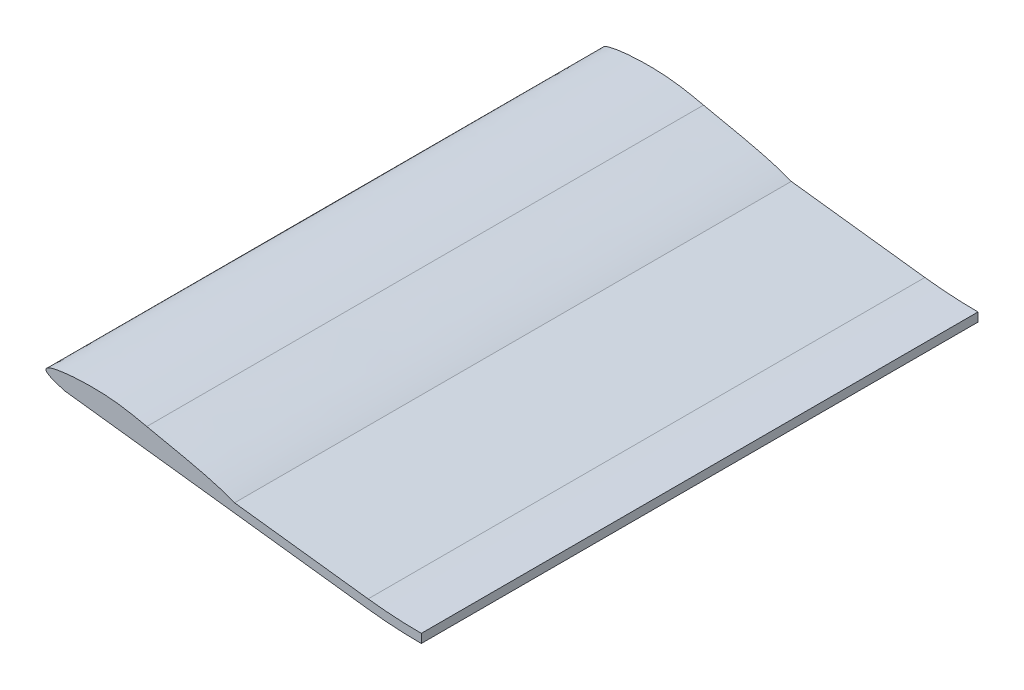
ISO-10303-21;
HEADER;
FILE_DESCRIPTION(('STEP AP214'),'2;1');
FILE_NAME('part.step','',(''),(''),'','','');
FILE_SCHEMA(('AUTOMOTIVE_DESIGN { 1 0 10303 214 1 1 1 1 }'));
ENDSEC;
DATA;
#1=APPLICATION_CONTEXT('core data for automotive mechanical design processes');
#2=APPLICATION_PROTOCOL_DEFINITION('international standard','automotive_design',2000,#1);
#3=PRODUCT_CONTEXT('',#1,'mechanical');
#4=PRODUCT('Part','Part','',(#3));
#5=PRODUCT_RELATED_PRODUCT_CATEGORY('part','',(#4));
#6=PRODUCT_DEFINITION_FORMATION('','',#4);
#7=PRODUCT_DEFINITION_CONTEXT('part definition',#1,'design');
#8=PRODUCT_DEFINITION('design','',#6,#7);
#9=PRODUCT_DEFINITION_SHAPE('','',#8);
#10=(LENGTH_UNIT() NAMED_UNIT(*) SI_UNIT(.MILLI.,.METRE.));
#11=(NAMED_UNIT(*) PLANE_ANGLE_UNIT() SI_UNIT($,.RADIAN.));
#12=(NAMED_UNIT(*) SI_UNIT($,.STERADIAN.) SOLID_ANGLE_UNIT());
#13=UNCERTAINTY_MEASURE_WITH_UNIT(LENGTH_MEASURE(1.E-05),#10,'distance_accuracy_value','');
#14=(GEOMETRIC_REPRESENTATION_CONTEXT(3) GLOBAL_UNCERTAINTY_ASSIGNED_CONTEXT((#13)) GLOBAL_UNIT_ASSIGNED_CONTEXT((#10,
#11,#12)) REPRESENTATION_CONTEXT('',''));
#15=CARTESIAN_POINT('',(0.,0.,0.));
#16=DIRECTION('',(0.,0.,1.));
#17=DIRECTION('',(1.,0.,0.));
#18=AXIS2_PLACEMENT_3D('',#15,#16,#17);
#19=CARTESIAN_POINT('',(-1376.89946624241,7.97944159795149,-300.));
#20=CARTESIAN_POINT('',(-1400.62692267339,14.4748176161241,-300.));
#21=CARTESIAN_POINT('',(-1356.47241270451,20.4165278977863,-300.));
#22=CARTESIAN_POINT('',(-1325.57377215526,12.1218735207099,-300.));
#23=CARTESIAN_POINT('',(-1294.16714389737,6.70322635564015,-300.));
#24=CARTESIAN_POINT('',(-1280.44105962162,1.1733876229176,-300.));
#25=B_SPLINE_CURVE_WITH_KNOTS('',3,(#19,#20,#21,#22,#23,#24),.UNSPECIFIED.,.F.,.F.,(4,1,1,4),
(0.,0.297228768096899,0.6124069189747,1.),.UNSPECIFIED.);
#26=DIRECTION('',(0.,0.,1.));
#27=VECTOR('',#26,1.);
#28=SURFACE_OF_LINEAR_EXTRUSION('',#25,#27);
#29=DIRECTION('',(0.,0.,1.));
#30=VECTOR('',#29,1.);
#31=CARTESIAN_POINT('',(-1387.26742948358,13.7744205498702,-300.));
#32=LINE('',#31,#30);
#33=CARTESIAN_POINT('',(-1387.26742948358,13.7744205498701,-616.));
#34=VERTEX_POINT('',#33);
#35=CARTESIAN_POINT('',(-1387.26742948358,13.7744205498702,-300.));
#36=VERTEX_POINT('',#35);
#37=EDGE_CURVE('E13',#34,#36,#32,.T.);
#38=ORIENTED_EDGE('',*,*,#37,.F.);
#39=CARTESIAN_POINT('',(-1376.89946624241,7.97944159795149,-616.));
#40=CARTESIAN_POINT('',(-1377.10559932181,8.03587358965808,-616.));
#41=CARTESIAN_POINT('',(-1377.31156661358,8.09291446148049,-616.));
#42=CARTESIAN_POINT('',(-1377.72572935339,8.20906121368225,-616.));
#43=CARTESIAN_POINT('',(-1377.93392003424,8.26818408733904,-616.));
#44=CARTESIAN_POINT('',(-1378.35202039858,8.38853903831141,-616.));
#45=CARTESIAN_POINT('',(-1378.56192563219,8.44978659180561,-616.));
#46=CARTESIAN_POINT('',(-1378.98293859683,8.57445775450962,-616.));
#47=CARTESIAN_POINT('',(-1379.19404230275,8.63789496779612,-616.));
#48=CARTESIAN_POINT('',(-1379.61692994093,8.76703358194975,-616.));
#49=CARTESIAN_POINT('',(-1379.82871045148,8.83274620515776,-616.));
#50=CARTESIAN_POINT('',(-1380.2524189195,8.96655496809938,-616.));
#51=CARTESIAN_POINT('',(-1380.46434427497,9.03465934888446,-616.));
#52=CARTESIAN_POINT('',(-1381.01661926945,9.21560731824085,-616.));
#53=CARTESIAN_POINT('',(-1381.35634383868,9.33036880620694,-616.));
#54=CARTESIAN_POINT('',(-1382.03278113928,9.56746067515487,-616.));
#55=CARTESIAN_POINT('',(-1382.36949655483,9.68978333205807,-616.));
#56=CARTESIAN_POINT('',(-1382.87104889133,9.88036922150825,-616.));
#57=CARTESIAN_POINT('',(-1383.03729210857,9.94493493954435,-616.));
#58=CARTESIAN_POINT('',(-1383.36865588585,10.076880636935,-616.));
#59=CARTESIAN_POINT('',(-1383.53377647864,10.1442605338004,-616.));
#60=CARTESIAN_POINT('',(-1383.86149752485,10.2818132154702,-616.));
#61=CARTESIAN_POINT('',(-1384.02410752631,10.3519631846966,-616.));
#62=CARTESIAN_POINT('',(-1384.34761813229,10.4960760338678,-616.));
#63=CARTESIAN_POINT('',(-1384.50851888743,10.570038574431,-616.));
#64=CARTESIAN_POINT('',(-1384.82686126228,10.7219573228579,-616.));
#65=CARTESIAN_POINT('',(-1384.98432024166,10.7998769397391,-616.));
#66=CARTESIAN_POINT('',(-1385.29634029246,10.9612864441184,-616.));
#67=CARTESIAN_POINT('',(-1385.45090179693,11.0447754905801,-616.));
#68=CARTESIAN_POINT('',(-1385.75570133815,11.2186366470378,-616.));
#69=CARTESIAN_POINT('',(-1385.90594844763,11.3089925920781,-616.));
#70=CARTESIAN_POINT('',(-1386.12677429788,11.4514583939343,-616.));
#71=CARTESIAN_POINT('',(-1386.19960142951,11.5000845793451,-616.));
#72=CARTESIAN_POINT('',(-1386.34335772149,11.6000579106691,-616.));
#73=CARTESIAN_POINT('',(-1386.41428723876,11.6514045393844,-616.));
#74=CARTESIAN_POINT('',(-1386.53555170717,11.7435233585069,-616.));
#75=CARTESIAN_POINT('',(-1386.58643944335,11.7835669771438,-616.));
#76=CARTESIAN_POINT('',(-1386.6866056491,11.8656933041869,-616.));
#77=CARTESIAN_POINT('',(-1386.73588305617,11.9077773151229,-616.));
#78=CARTESIAN_POINT('',(-1386.83244419358,11.9943143642011,-616.));
#79=CARTESIAN_POINT('',(-1386.87972513602,12.0387705308769,-616.));
#80=CARTESIAN_POINT('',(-1386.97059091361,12.1293005415215,-616.));
#81=CARTESIAN_POINT('',(-1387.01423572422,12.1753137178867,-616.));
#82=CARTESIAN_POINT('',(-1387.09821857093,12.2702207272159,-616.));
#83=CARTESIAN_POINT('',(-1387.13855920956,12.3191122398517,-616.));
#84=CARTESIAN_POINT('',(-1387.21485121182,12.4201126492647,-616.));
#85=CARTESIAN_POINT('',(-1387.25081147707,12.4722146857279,-616.));
#86=CARTESIAN_POINT('',(-1387.30106096528,12.5541229970213,-616.));
#87=CARTESIAN_POINT('',(-1387.3174701123,12.582633549943,-616.));
#88=CARTESIAN_POINT('',(-1387.34845005028,12.6406306504229,-616.));
#89=CARTESIAN_POINT('',(-1387.36302150547,12.6701168404522,-616.));
#90=CARTESIAN_POINT('',(-1387.39002206765,12.7300268742398,-616.));
#91=CARTESIAN_POINT('',(-1387.40245333555,12.7604497352233,-616.));
#92=CARTESIAN_POINT('',(-1387.42488132207,12.822217999786,-616.));
#93=CARTESIAN_POINT('',(-1387.43487526226,12.8535644109792,-616.));
#94=CARTESIAN_POINT('',(-1387.45813685873,12.9393939371932,-616.));
#95=CARTESIAN_POINT('',(-1387.46875829233,12.9946338603826,-616.));
#96=CARTESIAN_POINT('',(-1387.48046370835,13.1061062338817,-616.));
#97=CARTESIAN_POINT('',(-1387.48156012353,13.1623372943333,-616.));
#98=CARTESIAN_POINT('',(-1387.4757327961,13.2461719614413,-616.));
#99=CARTESIAN_POINT('',(-1387.47253393127,13.2740756171652,-616.));
#100=CARTESIAN_POINT('',(-1387.46370953273,13.329482149259,-616.));
#101=CARTESIAN_POINT('',(-1387.4580852809,13.3569852294156,-616.));
#102=CARTESIAN_POINT('',(-1387.43772393909,13.4386508538961,-616.));
#103=CARTESIAN_POINT('',(-1387.4194985435,13.491966056697,-616.));
#104=CARTESIAN_POINT('',(-1387.36788509003,13.6125051150773,-616.));
#105=CARTESIAN_POINT('',(-1387.33146256725,13.6784027181051,-616.));
#106=CARTESIAN_POINT('',(-1387.24878146527,13.8037156121293,-616.));
#107=CARTESIAN_POINT('',(-1387.20249721534,13.8631133607172,-616.));
#108=CARTESIAN_POINT('',(-1387.10784528255,13.9706784381311,-616.));
#109=CARTESIAN_POINT('',(-1387.060067443,14.0193763832744,-616.));
#110=CARTESIAN_POINT('',(-1386.96052103794,14.1125484682299,-616.));
#111=CARTESIAN_POINT('',(-1386.9087488983,14.157018743786,-616.));
#112=CARTESIAN_POINT('',(-1386.80219575232,14.2424261963095,-616.));
#113=CARTESIAN_POINT('',(-1386.74740790063,14.2833547430979,-616.));
#114=CARTESIAN_POINT('',(-1386.6356868198,14.3620951338664,-616.));
#115=CARTESIAN_POINT('',(-1386.57875447175,14.3999082379457,-616.));
#116=CARTESIAN_POINT('',(-1386.45642974705,14.4771870113068,-616.));
#117=CARTESIAN_POINT('',(-1386.39083032273,14.5163233554486,-616.));
#118=CARTESIAN_POINT('',(-1386.25803751536,14.5918031818058,-616.));
#119=CARTESIAN_POINT('',(-1386.19084378736,14.6281460522951,-616.));
#120=CARTESIAN_POINT('',(-1385.98718091869,14.7337244256374,-616.));
#121=CARTESIAN_POINT('',(-1385.84885226192,14.799373967021,-616.));
#122=CARTESIAN_POINT('',(-1385.5689168085,14.9235005623852,-616.));
#123=CARTESIAN_POINT('',(-1385.42730693435,14.9819705296954,-616.));
#124=CARTESIAN_POINT('',(-1385.1410493615,15.0935327548931,-616.));
#125=CARTESIAN_POINT('',(-1384.99638878677,15.1465917663851,-616.));
#126=CARTESIAN_POINT('',(-1384.70564654503,15.2479761349737,-616.));
#127=CARTESIAN_POINT('',(-1384.55956701678,15.296307675713,-616.));
#128=CARTESIAN_POINT('',(-1384.26626332117,15.3890821597214,-616.));
#129=CARTESIAN_POINT('',(-1384.11903974016,15.4335269681485,-616.));
#130=CARTESIAN_POINT('',(-1383.70995727964,15.5521257191271,-616.));
#131=CARTESIAN_POINT('',(-1383.44709363696,15.6228128159153,-616.));
#132=CARTESIAN_POINT('',(-1382.91936385474,15.7563266149848,-616.));
#133=CARTESIAN_POINT('',(-1382.65449740385,15.8191520673311,-616.));
#134=CARTESIAN_POINT('',(-1382.1229650218,15.9385384175811,-616.));
#135=CARTESIAN_POINT('',(-1381.85629705414,15.9950901984809,-616.));
#136=CARTESIAN_POINT('',(-1381.32189468029,16.1029161952263,-616.));
#137=CARTESIAN_POINT('',(-1381.05416024018,16.1541902417516,-616.));
#138=CARTESIAN_POINT('',(-1380.51749162167,16.2523274558758,-616.));
#139=CARTESIAN_POINT('',(-1380.24855627452,16.2991842044673,-616.));
#140=CARTESIAN_POINT('',(-1379.71003661255,16.3890063941388,-616.));
#141=CARTESIAN_POINT('',(-1379.44045228932,16.4319717844294,-616.));
#142=CARTESIAN_POINT('',(-1378.63087313839,16.5557690528167,-616.));
#143=CARTESIAN_POINT('',(-1378.09009502969,16.6314943563582,-616.));
#144=CARTESIAN_POINT('',(-1377.00807863036,16.7719034373336,-616.));
#145=CARTESIAN_POINT('',(-1376.46684273714,16.8366060102775,-616.));
#146=CARTESIAN_POINT('',(-1375.38398166942,16.9567972106447,-616.));
#147=CARTESIAN_POINT('',(-1374.84235764972,17.0122963004009,-616.));
#148=CARTESIAN_POINT('',(-1373.75855999863,17.1153570434646,-616.));
#149=CARTESIAN_POINT('',(-1373.21638663996,17.1629215860796,-616.));
#150=CARTESIAN_POINT('',(-1372.13129037316,17.250989964278,-616.));
#151=CARTESIAN_POINT('',(-1371.58836727717,17.2914914725964,-616.));
#152=CARTESIAN_POINT('',(-1370.45788606029,17.3690277519527,-616.));
#153=CARTESIAN_POINT('',(-1369.87029030527,17.4055123670845,-616.));
#154=CARTESIAN_POINT('',(-1368.69469438734,17.4713562862471,-616.));
#155=CARTESIAN_POINT('',(-1368.10669421964,17.5007155043084,-616.));
#156=CARTESIAN_POINT('',(-1366.92975208821,17.5525731669881,-616.));
#157=CARTESIAN_POINT('',(-1366.34080979512,17.5750641276652,-616.));
#158=CARTESIAN_POINT('',(-1365.1627048489,17.6131659820636,-616.));
#159=CARTESIAN_POINT('',(-1364.57354219659,17.6287769012033,-616.));
#160=CARTESIAN_POINT('',(-1363.39488815817,17.6528790911732,-616.));
#161=CARTESIAN_POINT('',(-1362.80539672663,17.6613681822236,-616.));
#162=CARTESIAN_POINT('',(-1361.62635710593,17.6708262212208,-616.));
#163=CARTESIAN_POINT('',(-1361.03680891679,17.6717951706705,-616.));
#164=CARTESIAN_POINT('',(-1359.26871468234,17.6628630854307,-616.));
#165=CARTESIAN_POINT('',(-1358.0901972813,17.641134449485,-616.));
#166=CARTESIAN_POINT('',(-1355.7354211015,17.5633291457871,-616.));
#167=CARTESIAN_POINT('',(-1354.55916124058,17.5072853824696,-616.));
#168=CARTESIAN_POINT('',(-1352.21047250895,17.3587173298899,-616.));
#169=CARTESIAN_POINT('',(-1351.03804062399,17.2662416437172,-616.));
#170=CARTESIAN_POINT('',(-1349.27898376581,17.099130438101,-616.));
#171=CARTESIAN_POINT('',(-1348.69099798329,17.0384941946363,-616.));
#172=CARTESIAN_POINT('',(-1347.51607457213,16.9078151103728,-616.));
#173=CARTESIAN_POINT('',(-1346.92913693121,16.837772380465,-616.));
#174=CARTESIAN_POINT('',(-1345.75650663328,16.6884650126062,-616.));
#175=CARTESIAN_POINT('',(-1345.17081384181,16.6092014282877,-616.));
#176=CARTESIAN_POINT('',(-1344.00070096476,16.4417904987352,-616.));
#177=CARTESIAN_POINT('',(-1343.41628087928,16.3536431528599,-616.));
#178=CARTESIAN_POINT('',(-1342.24846358651,16.168933334444,-616.));
#179=CARTESIAN_POINT('',(-1341.66506706899,16.0723665106585,-616.));
#180=CARTESIAN_POINT('',(-1340.49960044743,15.871553434744,-616.));
#181=CARTESIAN_POINT('',(-1339.91753034389,15.7673071797265,-616.));
#182=CARTESIAN_POINT('',(-1338.75414898549,15.5519101028218,-616.));
#183=CARTESIAN_POINT('',(-1338.17283883169,15.4407533516865,-616.));
#184=CARTESIAN_POINT('',(-1337.01136023702,15.2126426425003,-616.));
#185=CARTESIAN_POINT('',(-1336.43119179728,15.0956886787599,-616.));
#186=CARTESIAN_POINT('',(-1335.27135903696,14.8570416344822,-616.));
#187=CARTESIAN_POINT('',(-1334.69169546967,14.7353449057238,-616.));
#188=CARTESIAN_POINT('',(-1333.53309740608,14.4885414234781,-616.));
#189=CARTESIAN_POINT('',(-1332.9541629097,14.3634346703651,-616.));
#190=CARTESIAN_POINT('',(-1331.7965852555,14.1110606849079,-616.));
#191=CARTESIAN_POINT('',(-1331.21794223664,13.9837928174276,-616.));
#192=CARTESIAN_POINT('',(-1330.06084064353,13.7284216128202,-616.));
#193=CARTESIAN_POINT('',(-1329.48238206944,13.6003182749474,-616.));
#194=CARTESIAN_POINT('',(-1328.56177330007,13.3967834551106,-616.));
#195=CARTESIAN_POINT('',(-1328.21965242175,13.3212195861388,-616.));
#196=CARTESIAN_POINT('',(-1327.53532582951,13.1704770679976,-616.));
#197=CARTESIAN_POINT('',(-1327.19312011561,13.0952984187186,-616.));
#198=CARTESIAN_POINT('',(-1326.50857390825,12.9455618628941,-616.));
#199=CARTESIAN_POINT('',(-1326.16623341523,12.8710039543062,-616.));
#200=CARTESIAN_POINT('',(-1325.48137285666,12.7227173725383,-616.));
#201=CARTESIAN_POINT('',(-1325.13885279112,12.6489886993577,-616.));
#202=CARTESIAN_POINT('',(-1324.45384036181,12.5022659686637,-616.));
#203=CARTESIAN_POINT('',(-1324.11134807498,12.429271551655,-616.));
#204=CARTESIAN_POINT('',(-1323.42623990157,12.28386490226,-616.));
#205=CARTESIAN_POINT('',(-1323.08362401497,12.2114526700279,-616.));
#206=CARTESIAN_POINT('',(-1322.05562542676,11.9949210280287,-616.));
#207=CARTESIAN_POINT('',(-1321.3700941808,11.8515071819623,-616.));
#208=CARTESIAN_POINT('',(-1319.99914985061,11.56581206236,-616.));
#209=CARTESIAN_POINT('',(-1319.31373687545,11.4235302640729,-616.));
#210=CARTESIAN_POINT('',(-1317.94284733035,11.1392786548157,-616.));
#211=CARTESIAN_POINT('',(-1317.25737076051,10.9973088434122,-616.));
#212=CARTESIAN_POINT('',(-1315.88684576334,10.7130530691468,-616.));
#213=CARTESIAN_POINT('',(-1315.20179729529,10.5707673032964,-616.));
#214=CARTESIAN_POINT('',(-1313.83191912745,10.2851460845697,-616.));
#215=CARTESIAN_POINT('',(-1313.14708942773,10.141810631364,-616.));
#216=CARTESIAN_POINT('',(-1311.09383052273,9.70941761459142,-616.));
#217=CARTESIAN_POINT('',(-1309.72593073338,9.41782942400285,-616.));
#218=CARTESIAN_POINT('',(-1306.99328728128,8.82309915737215,-616.));
#219=CARTESIAN_POINT('',(-1305.62854245887,8.51996244097756,-616.));
#220=CARTESIAN_POINT('',(-1302.9214656525,7.9013198616558,-616.));
#221=CARTESIAN_POINT('',(-1301.57908234811,7.58603977988466,-616.));
#222=CARTESIAN_POINT('',(-1298.899515461,6.93431715587263,-616.));
#223=CARTESIAN_POINT('',(-1297.56233157365,6.5978758739784,-616.));
#224=CARTESIAN_POINT('',(-1294.89451333153,5.89822066925104,-616.));
#225=CARTESIAN_POINT('',(-1293.5638811182,5.53499854199399,-616.));
#226=CARTESIAN_POINT('',(-1290.91070850373,4.77529313800796,-616.));
#227=CARTESIAN_POINT('',(-1289.5881767995,4.37877917887172,-616.));
#228=CARTESIAN_POINT('',(-1287.61264016945,3.75339801911065,-616.));
#229=CARTESIAN_POINT('',(-1286.95485104388,3.53960673793806,-616.));
#230=CARTESIAN_POINT('',(-1285.64301898217,3.10085416624144,-616.));
#231=CARTESIAN_POINT('',(-1284.98897594333,2.87589318359945,-616.));
#232=CARTESIAN_POINT('',(-1283.68288751582,2.41282813502006,-616.));
#233=CARTESIAN_POINT('',(-1283.03085786298,2.17467955296651,-616.));
#234=CARTESIAN_POINT('',(-1281.7319099413,1.68465326262107,-616.));
#235=CARTESIAN_POINT('',(-1281.08499218569,1.43277419536898,-616.));
#236=CARTESIAN_POINT('',(-1280.44105962162,1.1733876229176,-616.));
#237=B_SPLINE_CURVE_WITH_KNOTS('',3,(#39,#40,#41,#42,#43,#44,#45,#46,#47,#48,#49,#50,#51,#52,
#53,#54,#55,#56,#57,#58,#59,#60,#61,#62,#63,#64,#65,#66,#67,#68,#69,#70,#71,#72,#73,#74,#75,#76,
#77,#78,#79,#80,#81,#82,#83,#84,#85,#86,#87,#88,#89,#90,#91,#92,#93,#94,#95,#96,#97,#98,#99,
#100,#101,#102,#103,#104,#105,#106,#107,#108,#109,#110,#111,#112,#113,#114,#115,#116,#117,#118,
#119,#120,#121,#122,#123,#124,#125,#126,#127,#128,#129,#130,#131,#132,#133,#134,#135,#136,#137,
#138,#139,#140,#141,#142,#143,#144,#145,#146,#147,#148,#149,#150,#151,#152,#153,#154,#155,#156,
#157,#158,#159,#160,#161,#162,#163,#164,#165,#166,#167,#168,#169,#170,#171,#172,#173,#174,#175,
#176,#177,#178,#179,#180,#181,#182,#183,#184,#185,#186,#187,#188,#189,#190,#191,#192,#193,#194,
#195,#196,#197,#198,#199,#200,#201,#202,#203,#204,#205,#206,#207,#208,#209,#210,#211,#212,#213,
#214,#215,#216,#217,#218,#219,#220,#221,#222,#223,#224,#225,#226,#227,#228,#229,#230,#231,#232,
#233,#234,#235,#236),.UNSPECIFIED.,.F.,.F.,(4,2,2,2,2,2,2,2,2,2,2,2,2,2,2,2,2,2,2,2,2,2,2,2,2,2,
2,2,2,2,2,2,2,2,2,2,2,2,2,2,2,2,2,2,2,2,2,2,2,2,2,2,2,2,2,2,2,2,2,2,2,2,2,2,2,2,2,2,2,2,2,2,2,2,
2,2,2,2,2,2,2,2,2,2,2,2,2,2,2,2,2,2,2,2,2,2,2,2,4),(0.,0.641154592746128,1.29041849442369,
1.94638712900553,2.60766715794277,3.27288016488498,3.94066790590432,5.01635177545694,
6.09095438561435,6.6259573071867,7.16094455776156,7.69219208949669,8.22339241286647,
8.75035257158444,9.27723333370757,9.80291008332669,10.065569713323,10.3281795856465,
10.5223987803484,10.7167436350056,10.9113514623093,11.1014863007959,11.2914699096956,
11.481060761776,11.5796933107784,11.678290107021,11.7767867604165,11.8753951751834,
12.0434034731278,12.2111924411461,12.2953557880387,12.3794747070118,12.547723599081,
12.7723540117534,12.9975764562909,13.2019424339759,13.406493449483,13.6115296306195,
13.8164824696922,14.0455581495666,14.2746838512757,14.7337143201391,15.1931942982915,
15.6553459931179,16.1168848637935,16.578201022543,17.3946299902428,18.2111885987626,
19.0289187150571,19.8466750575939,20.6656019759419,21.4845395812372,23.1225454928307,
24.7577297632126,26.3910422541026,28.0237586816926,29.6570120759142,31.423147691864,
33.1893046155154,34.957379206863,36.7254472660172,38.4940562810084,40.2626649425498,
43.798317307298,47.3305846680499,50.8581555737525,52.6314045851498,54.4046326939167,
56.177658381195,57.9506841964803,59.7246318177563,61.4985801062894,63.2740720409073,
65.0495657180466,66.8264531906288,68.6033404681826,70.3807593226059,72.1581797639168,
73.2092787718865,74.2603774807273,75.3114727297279,76.3625679779863,77.413120758471,
78.4636738173498,80.5647872484503,82.6648621812686,84.7649341947539,86.8639404244796,
88.9629473131615,93.15881486224,97.3527582891799,101.489360744496,105.625717059459,
109.763345872221,113.904830767026,115.979727780587,118.054567633333,120.136897892016,
122.219434622649),.UNSPECIFIED.);
#238=CARTESIAN_POINT('',(-1376.89946624241,7.97944159795149,-616.));
#239=VERTEX_POINT('',#238);
#240=EDGE_CURVE('E152',#239,#34,#237,.T.);
#241=ORIENTED_EDGE('',*,*,#240,.F.);
#242=DIRECTION('',(0.,0.,1.));
#243=VECTOR('',#242,1.);
#244=CARTESIAN_POINT('',(-1376.89946624241,7.97944159795149,-300.));
#245=LINE('',#244,#243);
#246=CARTESIAN_POINT('',(-1376.89946624241,7.97944159795149,-300.));
#247=VERTEX_POINT('',#246);
#248=EDGE_CURVE('E220',#239,#247,#245,.T.);
#249=ORIENTED_EDGE('',*,*,#248,.T.);
#250=CARTESIAN_POINT('',(-1376.89946624241,7.97944159795149,-300.));
#251=CARTESIAN_POINT('',(-1400.62692267339,14.4748176161241,-300.));
#252=CARTESIAN_POINT('',(-1356.47241270451,20.4165278977863,-300.));
#253=CARTESIAN_POINT('',(-1325.57377215526,12.1218735207099,-300.));
#254=CARTESIAN_POINT('',(-1294.16714389737,6.70322635564015,-300.));
#255=CARTESIAN_POINT('',(-1280.44105962162,1.1733876229176,-300.));
#256=B_SPLINE_CURVE_WITH_KNOTS('',3,(#250,#251,#252,#253,#254,#255),.UNSPECIFIED.,.F.,.F.,(4,1,
1,4),(0.,0.297228768096899,0.6124069189747,1.),.UNSPECIFIED.);
#257=EDGE_CURVE('E207',#247,#36,#256,.T.);
#258=ORIENTED_EDGE('',*,*,#257,.T.);
#259=EDGE_LOOP('',(#38,#241,#249,#258));
#260=FACE_BOUND('',#259,.T.);
#261=ADVANCED_FACE('F55',(#260),#28,.F.);
#262=DIRECTION('',(0.,0.,1.));
#263=VECTOR('',#262,1.);
#264=CARTESIAN_POINT('',(-1330.26950820948,13.7744205498702,-300.));
#265=LINE('',#264,#263);
#266=CARTESIAN_POINT('',(-1330.26950820948,13.7744205498703,-300.));
#267=VERTEX_POINT('',#266);
#268=CARTESIAN_POINT('',(-1330.26950820948,13.7744205498702,-616.));
#269=VERTEX_POINT('',#268);
#270=EDGE_CURVE('E59',#267,#269,#265,.F.);
#271=ORIENTED_EDGE('',*,*,#270,.F.);
#272=CARTESIAN_POINT('',(-1280.44105962162,1.17338762291759,-300.));
#273=VERTEX_POINT('',#272);
#274=EDGE_CURVE('E198',#267,#273,#256,.T.);
#275=ORIENTED_EDGE('',*,*,#274,.T.);
#276=DIRECTION('',(0.,0.,1.));
#277=VECTOR('',#276,1.);
#278=CARTESIAN_POINT('',(-1280.44105962162,1.1733876229176,-300.));
#279=LINE('',#278,#277);
#280=CARTESIAN_POINT('',(-1280.44105962162,1.1733876229176,-616.));
#281=VERTEX_POINT('',#280);
#282=EDGE_CURVE('E225',#281,#273,#279,.T.);
#283=ORIENTED_EDGE('',*,*,#282,.F.);
#284=EDGE_CURVE('E150',#269,#281,#237,.T.);
#285=ORIENTED_EDGE('',*,*,#284,.F.);
#286=EDGE_LOOP('',(#271,#275,#283,#285));
#287=FACE_BOUND('',#286,.T.);
#288=ADVANCED_FACE('F185',(#287),#28,.F.);
#289=CARTESIAN_POINT('',(-1189.74693314729,-15.,-300.));
#290=DIRECTION('',(0.121869343405148,0.992546151641322,0.));
#291=DIRECTION('',(-0.992546151641322,0.121869343405148,0.));
#292=AXIS2_PLACEMENT_3D('',#289,#290,#291);
#293=PLANE('',#292);
#294=DIRECTION('',(0.,0.,-1.));
#295=VECTOR('',#294,1.);
#296=CARTESIAN_POINT('',(-1204.92361396095,-13.1365379103305,-300.));
#297=LINE('',#296,#295);
#298=CARTESIAN_POINT('',(-1204.92361396095,-13.1365379103304,-616.));
#299=VERTEX_POINT('',#298);
#300=CARTESIAN_POINT('',(-1204.92361396095,-13.1365379103305,-300.));
#301=VERTEX_POINT('',#300);
#302=EDGE_CURVE('E231',#299,#301,#297,.F.);
#303=ORIENTED_EDGE('',*,*,#302,.T.);
#304=DIRECTION('',(-0.992546151641322,0.121869343405148,0.));
#305=VECTOR('',#304,1.);
#306=CARTESIAN_POINT('',(-1189.74693314729,-15.,-300.));
#307=LINE('',#306,#305);
#308=EDGE_CURVE('E208',#301,#247,#307,.T.);
#309=ORIENTED_EDGE('',*,*,#308,.T.);
#310=ORIENTED_EDGE('',*,*,#248,.F.);
#311=DIRECTION('',(-0.992546151641322,0.121869343405147,0.));
#312=VECTOR('',#311,1.);
#313=CARTESIAN_POINT('',(-1204.92361396095,-13.1365379103303,-616.));
#314=LINE('',#313,#312);
#315=EDGE_CURVE('E147',#299,#239,#314,.T.);
#316=ORIENTED_EDGE('',*,*,#315,.F.);
#317=EDGE_LOOP('',(#303,#309,#310,#316));
#318=FACE_BOUND('',#317,.T.);
#319=ADVANCED_FACE('F184',(#318),#293,.F.);
#320=EDGE_CURVE('E161',#34,#269,#237,.T.);
#321=ORIENTED_EDGE('',*,*,#320,.F.);
#322=ORIENTED_EDGE('',*,*,#37,.T.);
#323=EDGE_CURVE('E204',#36,#267,#256,.T.);
#324=ORIENTED_EDGE('',*,*,#323,.T.);
#325=ORIENTED_EDGE('',*,*,#270,.T.);
#326=EDGE_LOOP('',(#321,#322,#324,#325));
#327=FACE_BOUND('',#326,.T.);
#328=ADVANCED_FACE('F162',(#327),#28,.F.);
#329=CARTESIAN_POINT('',(-1280.44105962162,1.1733876229176,-300.));
#330=DIRECTION('',(-0.121869343405141,-0.992546151641323,0.));
#331=DIRECTION('',(0.992546151641323,-0.121869343405141,0.));
#332=AXIS2_PLACEMENT_3D('',#329,#330,#331);
#333=PLANE('',#332);
#334=ORIENTED_EDGE('',*,*,#282,.T.);
#335=DIRECTION('',(0.992546151641323,-0.121869343405141,0.));
#336=VECTOR('',#335,1.);
#337=CARTESIAN_POINT('',(-1280.44105962162,1.1733876229176,-300.));
#338=LINE('',#337,#336);
#339=CARTESIAN_POINT('',(-1204.6178008602,-8.13653791033056,-300.));
#340=VERTEX_POINT('',#339);
#341=EDGE_CURVE('E127',#273,#340,#338,.T.);
#342=ORIENTED_EDGE('',*,*,#341,.T.);
#343=DIRECTION('',(0.,0.,1.));
#344=VECTOR('',#343,1.);
#345=CARTESIAN_POINT('',(-1204.6178008602,-8.13653791033053,-300.));
#346=LINE('',#345,#344);
#347=CARTESIAN_POINT('',(-1204.6178008602,-8.1365379103305,-616.));
#348=VERTEX_POINT('',#347);
#349=EDGE_CURVE('E234',#340,#348,#346,.F.);
#350=ORIENTED_EDGE('',*,*,#349,.T.);
#351=DIRECTION('',(0.992546151641323,-0.121869343405141,0.));
#352=VECTOR('',#351,1.);
#353=CARTESIAN_POINT('',(-1280.44105962162,1.1733876229176,-616.));
#354=LINE('',#353,#352);
#355=EDGE_CURVE('E143',#281,#348,#354,.T.);
#356=ORIENTED_EDGE('',*,*,#355,.F.);
#357=EDGE_LOOP('',(#334,#342,#350,#356));
#358=FACE_BOUND('',#357,.T.);
#359=ADVANCED_FACE('F175',(#358),#333,.F.);
#360=CARTESIAN_POINT('',(-1174.45627810966,235.,305.));
#361=DIRECTION('',(0.,0.,-1.));
#362=DIRECTION('',(-1.,0.,0.));
#363=AXIS2_PLACEMENT_3D('',#360,#361,#362);
#364=CYLINDRICAL_SURFACE('',#363,250.);
#365=CARTESIAN_POINT('',(-1174.45627810966,235.,-300.));
#366=DIRECTION('',(0.,0.,-1.));
#367=DIRECTION('',(-1.,0.,0.));
#368=AXIS2_PLACEMENT_3D('',#365,#366,#367);
#369=CIRCLE('',#368,250.);
#370=CARTESIAN_POINT('',(-1174.45627810966,-15.,-300.));
#371=VERTEX_POINT('',#370);
#372=EDGE_CURVE('E218',#301,#371,#369,.F.);
#373=ORIENTED_EDGE('',*,*,#372,.F.);
#374=ORIENTED_EDGE('',*,*,#302,.F.);
#375=CARTESIAN_POINT('',(-1174.45627810966,235.,-616.));
#376=DIRECTION('',(0.,0.,-1.));
#377=DIRECTION('',(-1.,0.,0.));
#378=AXIS2_PLACEMENT_3D('',#375,#376,#377);
#379=CIRCLE('',#378,250.);
#380=CARTESIAN_POINT('',(-1174.45627810966,-14.9999999999999,-616.));
#381=VERTEX_POINT('',#380);
#382=EDGE_CURVE('E138',#381,#299,#379,.T.);
#383=ORIENTED_EDGE('',*,*,#382,.F.);
#384=DIRECTION('',(0.,0.,-1.));
#385=VECTOR('',#384,1.);
#386=CARTESIAN_POINT('',(-1174.45627810966,-15.,305.));
#387=LINE('',#386,#385);
#388=EDGE_CURVE('E134',#371,#381,#387,.T.);
#389=ORIENTED_EDGE('',*,*,#388,.F.);
#390=EDGE_LOOP('',(#373,#374,#383,#389));
#391=FACE_BOUND('',#390,.T.);
#392=ADVANCED_FACE('F177',(#391),#364,.T.);
#393=CARTESIAN_POINT('',(-1174.15046500891,240.,-300.));
#394=DIRECTION('',(0.,0.,-1.));
#395=DIRECTION('',(-1.,0.,0.));
#396=AXIS2_PLACEMENT_3D('',#393,#394,#395);
#397=CYLINDRICAL_SURFACE('',#396,250.);
#398=CARTESIAN_POINT('',(-1174.15046500891,240.,-300.));
#399=DIRECTION('',(0.,0.,-1.));
#400=DIRECTION('',(-1.,0.,0.));
#401=AXIS2_PLACEMENT_3D('',#398,#399,#400);
#402=CIRCLE('',#401,250.);
#403=CARTESIAN_POINT('',(-1174.45627810966,-9.99981295662467,-300.));
#404=VERTEX_POINT('',#403);
#405=EDGE_CURVE('E124',#340,#404,#402,.F.);
#406=ORIENTED_EDGE('',*,*,#405,.T.);
#407=DIRECTION('',(0.,0.,-1.));
#408=VECTOR('',#407,1.);
#409=CARTESIAN_POINT('',(-1174.45627810966,-9.99981295662464,-300.));
#410=LINE('',#409,#408);
#411=CARTESIAN_POINT('',(-1174.45627810966,-9.99981295662464,-616.));
#412=VERTEX_POINT('',#411);
#413=EDGE_CURVE('E119',#404,#412,#410,.T.);
#414=ORIENTED_EDGE('',*,*,#413,.T.);
#415=CARTESIAN_POINT('',(-1174.15046500891,240.,-616.));
#416=DIRECTION('',(0.,0.,1.));
#417=DIRECTION('',(-1.,0.,0.));
#418=AXIS2_PLACEMENT_3D('',#415,#416,#417);
#419=CIRCLE('',#418,250.);
#420=EDGE_CURVE('E123',#348,#412,#419,.T.);
#421=ORIENTED_EDGE('',*,*,#420,.F.);
#422=ORIENTED_EDGE('',*,*,#349,.F.);
#423=EDGE_LOOP('',(#406,#414,#421,#422));
#424=FACE_BOUND('',#423,.T.);
#425=ADVANCED_FACE('F57',(#424),#397,.F.);
#426=CARTESIAN_POINT('',(-1174.15046500891,-400.,-300.));
#427=DIRECTION('',(0.,0.,-1.));
#428=DIRECTION('',(-1.,0.,0.));
#429=AXIS2_PLACEMENT_3D('',#426,#427,#428);
#430=PLANE('',#429);
#431=ORIENTED_EDGE('',*,*,#372,.T.);
#432=DIRECTION('',(0.,1.,0.));
#433=VECTOR('',#432,1.);
#434=CARTESIAN_POINT('',(-1174.45627810966,-16.8133173139919,-300.));
#435=LINE('',#434,#433);
#436=EDGE_CURVE('E128',#371,#404,#435,.T.);
#437=ORIENTED_EDGE('',*,*,#436,.T.);
#438=ORIENTED_EDGE('',*,*,#405,.F.);
#439=ORIENTED_EDGE('',*,*,#341,.F.);
#440=ORIENTED_EDGE('',*,*,#274,.F.);
#441=ORIENTED_EDGE('',*,*,#323,.F.);
#442=ORIENTED_EDGE('',*,*,#257,.F.);
#443=ORIENTED_EDGE('',*,*,#308,.F.);
#444=EDGE_LOOP('',(#431,#437,#438,#439,#440,#441,#442,#443));
#445=FACE_BOUND('',#444,.T.);
#446=ADVANCED_FACE('F172',(#445),#430,.F.);
#447=CARTESIAN_POINT('',(-1174.45627810966,-15.,-300.));
#448=DIRECTION('',(-1.,0.,0.));
#449=DIRECTION('',(0.,0.,1.));
#450=AXIS2_PLACEMENT_3D('',#447,#448,#449);
#451=PLANE('',#450);
#452=ORIENTED_EDGE('',*,*,#388,.T.);
#453=DIRECTION('',(0.,-1.,0.));
#454=VECTOR('',#453,1.);
#455=CARTESIAN_POINT('',(-1174.45627810966,-9.99981295662464,-616.));
#456=LINE('',#455,#454);
#457=EDGE_CURVE('E131',#412,#381,#456,.T.);
#458=ORIENTED_EDGE('',*,*,#457,.F.);
#459=ORIENTED_EDGE('',*,*,#413,.F.);
#460=ORIENTED_EDGE('',*,*,#436,.F.);
#461=EDGE_LOOP('',(#452,#458,#459,#460));
#462=FACE_BOUND('',#461,.T.);
#463=ADVANCED_FACE('F132',(#462),#451,.F.);
#464=CARTESIAN_POINT('',(-1174.15046500891,240.,-616.));
#465=DIRECTION('',(0.,0.,-1.));
#466=DIRECTION('',(-1.,0.,0.));
#467=AXIS2_PLACEMENT_3D('',#464,#465,#466);
#468=PLANE('',#467);
#469=ORIENTED_EDGE('',*,*,#420,.T.);
#470=ORIENTED_EDGE('',*,*,#457,.T.);
#471=ORIENTED_EDGE('',*,*,#382,.T.);
#472=ORIENTED_EDGE('',*,*,#315,.T.);
#473=ORIENTED_EDGE('',*,*,#240,.T.);
#474=ORIENTED_EDGE('',*,*,#320,.T.);
#475=ORIENTED_EDGE('',*,*,#284,.T.);
#476=ORIENTED_EDGE('',*,*,#355,.T.);
#477=EDGE_LOOP('',(#469,#470,#471,#472,#473,#474,#475,#476));
#478=FACE_BOUND('',#477,.T.);
#479=ADVANCED_FACE('F141',(#478),#468,.T.);
#480=CLOSED_SHELL('',(#261,#288,#319,#328,#359,#392,#425,#446,#463,#479));
#481=MANIFOLD_SOLID_BREP('B2',#480);
#482=ADVANCED_BREP_SHAPE_REPRESENTATION('',(#18,#481),#14);
#483=SHAPE_DEFINITION_REPRESENTATION(#9,#482);
ENDSEC;
END-ISO-10303-21;
